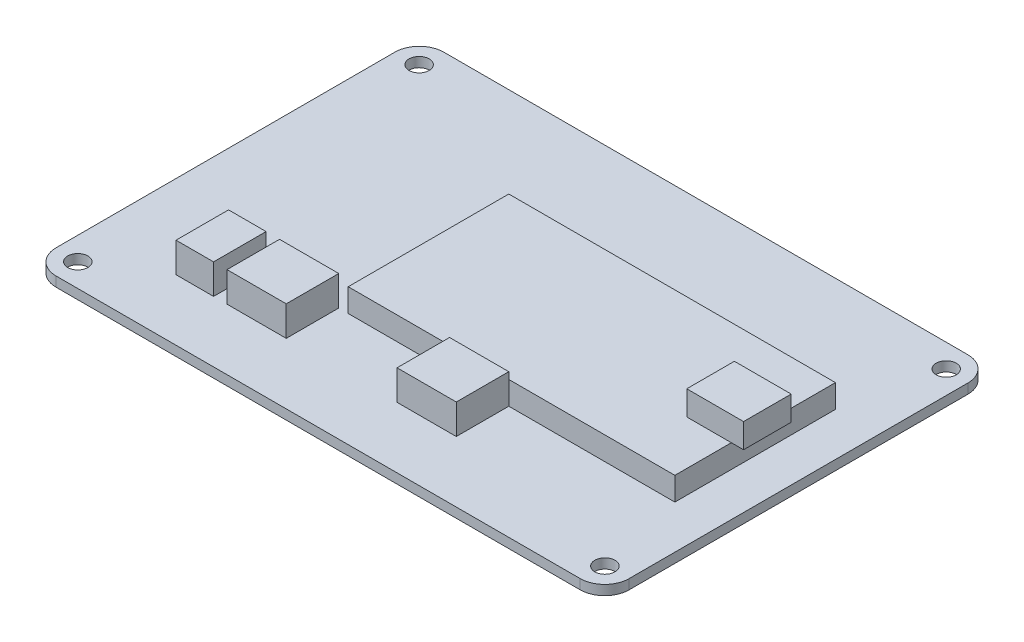
ISO-10303-21;
HEADER;
FILE_DESCRIPTION(('STEP AP214'),'2;1');
FILE_NAME('part.step','',(''),(''),'','','');
FILE_SCHEMA(('AUTOMOTIVE_DESIGN { 1 0 10303 214 1 1 1 1 }'));
ENDSEC;
DATA;
#1=APPLICATION_CONTEXT('core data for automotive mechanical design processes');
#2=APPLICATION_PROTOCOL_DEFINITION('international standard','automotive_design',2000,#1);
#3=PRODUCT_CONTEXT('',#1,'mechanical');
#4=PRODUCT('Part','Part','',(#3));
#5=PRODUCT_RELATED_PRODUCT_CATEGORY('part','',(#4));
#6=PRODUCT_DEFINITION_FORMATION('','',#4);
#7=PRODUCT_DEFINITION_CONTEXT('part definition',#1,'design');
#8=PRODUCT_DEFINITION('design','',#6,#7);
#9=PRODUCT_DEFINITION_SHAPE('','',#8);
#10=(LENGTH_UNIT() NAMED_UNIT(*) SI_UNIT(.MILLI.,.METRE.));
#11=(NAMED_UNIT(*) PLANE_ANGLE_UNIT() SI_UNIT($,.RADIAN.));
#12=(NAMED_UNIT(*) SI_UNIT($,.STERADIAN.) SOLID_ANGLE_UNIT());
#13=UNCERTAINTY_MEASURE_WITH_UNIT(LENGTH_MEASURE(1.E-05),#10,'distance_accuracy_value','');
#14=(GEOMETRIC_REPRESENTATION_CONTEXT(3) GLOBAL_UNCERTAINTY_ASSIGNED_CONTEXT((#13)) GLOBAL_UNIT_ASSIGNED_CONTEXT((#10,
#11,#12)) REPRESENTATION_CONTEXT('',''));
#15=CARTESIAN_POINT('',(0.,0.,0.));
#16=DIRECTION('',(0.,0.,1.));
#17=DIRECTION('',(1.,0.,0.));
#18=AXIS2_PLACEMENT_3D('',#15,#16,#17);
#19=CARTESIAN_POINT('',(0.,1.6,0.));
#20=DIRECTION('',(0.,1.,0.));
#21=DIRECTION('',(0.,0.,1.));
#22=AXIS2_PLACEMENT_3D('',#19,#20,#21);
#23=PLANE('',#22);
#24=CARTESIAN_POINT('',(43.1625,1.6,27.95));
#25=DIRECTION('',(0.,1.,0.));
#26=DIRECTION('',(0.,0.,1.));
#27=AXIS2_PLACEMENT_3D('',#24,#25,#26);
#28=CIRCLE('',#27,1.65);
#29=CARTESIAN_POINT('',(43.1625,1.6,29.6));
#30=VERTEX_POINT('',#29);
#31=EDGE_CURVE('E392',#30,#30,#28,.T.);
#32=ORIENTED_EDGE('',*,*,#31,.F.);
#33=EDGE_LOOP('',(#32));
#34=FACE_BOUND('',#33,.T.);
#35=CARTESIAN_POINT('',(-43.1625,1.6,-27.95));
#36=DIRECTION('',(0.,1.,0.));
#37=DIRECTION('',(0.,0.,1.));
#38=AXIS2_PLACEMENT_3D('',#35,#36,#37);
#39=CIRCLE('',#38,1.65);
#40=CARTESIAN_POINT('',(-43.1625,1.6,-26.3));
#41=VERTEX_POINT('',#40);
#42=EDGE_CURVE('E404',#41,#41,#39,.T.);
#43=ORIENTED_EDGE('',*,*,#42,.F.);
#44=EDGE_LOOP('',(#43));
#45=FACE_BOUND('',#44,.T.);
#46=DIRECTION('',(-1.,0.,0.));
#47=VECTOR('',#46,1.);
#48=CARTESIAN_POINT('',(-46.925,1.6,-31.75));
#49=LINE('',#48,#47);
#50=CARTESIAN_POINT('',(42.925,1.6,-31.75));
#51=VERTEX_POINT('',#50);
#52=CARTESIAN_POINT('',(-42.925,1.6,-31.75));
#53=VERTEX_POINT('',#52);
#54=EDGE_CURVE('E413',#51,#53,#49,.T.);
#55=ORIENTED_EDGE('',*,*,#54,.T.);
#56=CARTESIAN_POINT('',(-42.925,1.6,-27.75));
#57=DIRECTION('',(0.,1.,0.));
#58=DIRECTION('',(0.,0.,1.));
#59=AXIS2_PLACEMENT_3D('',#56,#57,#58);
#60=CIRCLE('',#59,4.);
#61=CARTESIAN_POINT('',(-46.925,1.6,-27.75));
#62=VERTEX_POINT('',#61);
#63=EDGE_CURVE('E457',#53,#62,#60,.T.);
#64=ORIENTED_EDGE('',*,*,#63,.T.);
#65=DIRECTION('',(0.,0.,1.));
#66=VECTOR('',#65,1.);
#67=CARTESIAN_POINT('',(-46.925,1.6,-31.75));
#68=LINE('',#67,#66);
#69=CARTESIAN_POINT('',(-46.925,1.6,27.75));
#70=VERTEX_POINT('',#69);
#71=EDGE_CURVE('E417',#62,#70,#68,.T.);
#72=ORIENTED_EDGE('',*,*,#71,.T.);
#73=CARTESIAN_POINT('',(-42.925,1.6,27.75));
#74=DIRECTION('',(0.,1.,0.));
#75=DIRECTION('',(0.,0.,1.));
#76=AXIS2_PLACEMENT_3D('',#73,#74,#75);
#77=CIRCLE('',#76,4.);
#78=CARTESIAN_POINT('',(-42.925,1.6,31.75));
#79=VERTEX_POINT('',#78);
#80=EDGE_CURVE('E451',#70,#79,#77,.T.);
#81=ORIENTED_EDGE('',*,*,#80,.T.);
#82=DIRECTION('',(1.,0.,0.));
#83=VECTOR('',#82,1.);
#84=CARTESIAN_POINT('',(-46.925,1.6,31.75));
#85=LINE('',#84,#83);
#86=CARTESIAN_POINT('',(42.925,1.6,31.75));
#87=VERTEX_POINT('',#86);
#88=EDGE_CURVE('E420',#79,#87,#85,.T.);
#89=ORIENTED_EDGE('',*,*,#88,.T.);
#90=CARTESIAN_POINT('',(42.925,1.6,27.75));
#91=DIRECTION('',(0.,1.,0.));
#92=DIRECTION('',(0.,0.,1.));
#93=AXIS2_PLACEMENT_3D('',#90,#91,#92);
#94=CIRCLE('',#93,4.);
#95=CARTESIAN_POINT('',(46.925,1.6,27.75));
#96=VERTEX_POINT('',#95);
#97=EDGE_CURVE('E453',#87,#96,#94,.T.);
#98=ORIENTED_EDGE('',*,*,#97,.T.);
#99=DIRECTION('',(0.,0.,-1.));
#100=VECTOR('',#99,1.);
#101=CARTESIAN_POINT('',(46.925,1.6,-31.75));
#102=LINE('',#101,#100);
#103=CARTESIAN_POINT('',(46.925,1.6,-27.75));
#104=VERTEX_POINT('',#103);
#105=EDGE_CURVE('E410',#96,#104,#102,.T.);
#106=ORIENTED_EDGE('',*,*,#105,.T.);
#107=CARTESIAN_POINT('',(42.925,1.6,-27.75));
#108=DIRECTION('',(0.,1.,0.));
#109=DIRECTION('',(0.,0.,1.));
#110=AXIS2_PLACEMENT_3D('',#107,#108,#109);
#111=CIRCLE('',#110,4.);
#112=EDGE_CURVE('E455',#104,#51,#111,.T.);
#113=ORIENTED_EDGE('',*,*,#112,.T.);
#114=EDGE_LOOP('',(#55,#64,#72,#81,#89,#98,#106,#113));
#115=FACE_BOUND('',#114,.T.);
#116=CARTESIAN_POINT('',(43.1625,1.6,-27.95));
#117=DIRECTION('',(0.,1.,0.));
#118=DIRECTION('',(0.,0.,-1.));
#119=AXIS2_PLACEMENT_3D('',#116,#117,#118);
#120=CIRCLE('',#119,1.65);
#121=CARTESIAN_POINT('',(43.1625,1.6,-29.6));
#122=VERTEX_POINT('',#121);
#123=EDGE_CURVE('E398',#122,#122,#120,.T.);
#124=ORIENTED_EDGE('',*,*,#123,.F.);
#125=EDGE_LOOP('',(#124));
#126=FACE_BOUND('',#125,.T.);
#127=CARTESIAN_POINT('',(-43.1625,1.6,27.95));
#128=DIRECTION('',(0.,1.,0.));
#129=DIRECTION('',(0.,0.,-1.));
#130=AXIS2_PLACEMENT_3D('',#127,#128,#129);
#131=CIRCLE('',#130,1.65);
#132=CARTESIAN_POINT('',(-43.1625,1.6,26.3));
#133=VERTEX_POINT('',#132);
#134=EDGE_CURVE('E386',#133,#133,#131,.T.);
#135=ORIENTED_EDGE('',*,*,#134,.F.);
#136=EDGE_LOOP('',(#135));
#137=FACE_BOUND('',#136,.T.);
#138=DIRECTION('',(1.,0.,0.));
#139=VECTOR('',#138,1.);
#140=CARTESIAN_POINT('',(2.925,1.6,21.75));
#141=LINE('',#140,#139);
#142=CARTESIAN_POINT('',(2.925,1.6,21.75));
#143=VERTEX_POINT('',#142);
#144=CARTESIAN_POINT('',(12.625,1.6,21.75));
#145=VERTEX_POINT('',#144);
#146=EDGE_CURVE('E303',#143,#145,#141,.T.);
#147=ORIENTED_EDGE('',*,*,#146,.F.);
#148=DIRECTION('',(0.,0.,1.));
#149=VECTOR('',#148,1.);
#150=CARTESIAN_POINT('',(2.925,1.6,13.15));
#151=LINE('',#150,#149);
#152=CARTESIAN_POINT('',(2.925,1.6,13.15));
#153=VERTEX_POINT('',#152);
#154=EDGE_CURVE('E289',#153,#143,#151,.T.);
#155=ORIENTED_EDGE('',*,*,#154,.F.);
#156=DIRECTION('',(1.,0.,0.));
#157=VECTOR('',#156,1.);
#158=CARTESIAN_POINT('',(-13.675,1.6,13.15));
#159=LINE('',#158,#157);
#160=CARTESIAN_POINT('',(-13.675,1.6,13.15));
#161=VERTEX_POINT('',#160);
#162=EDGE_CURVE('E373',#161,#153,#159,.T.);
#163=ORIENTED_EDGE('',*,*,#162,.F.);
#164=DIRECTION('',(0.,0.,1.));
#165=VECTOR('',#164,1.);
#166=CARTESIAN_POINT('',(-13.675,1.6,-13.15));
#167=LINE('',#166,#165);
#168=CARTESIAN_POINT('',(-13.675,1.6,-13.15));
#169=VERTEX_POINT('',#168);
#170=EDGE_CURVE('E369',#169,#161,#167,.T.);
#171=ORIENTED_EDGE('',*,*,#170,.F.);
#172=DIRECTION('',(-1.,0.,0.));
#173=VECTOR('',#172,1.);
#174=CARTESIAN_POINT('',(-13.675,1.6,-13.15));
#175=LINE('',#174,#173);
#176=CARTESIAN_POINT('',(39.825,1.6,-13.15));
#177=VERTEX_POINT('',#176);
#178=EDGE_CURVE('E367',#177,#169,#175,.T.);
#179=ORIENTED_EDGE('',*,*,#178,.F.);
#180=DIRECTION('',(0.,0.,-1.));
#181=VECTOR('',#180,1.);
#182=CARTESIAN_POINT('',(39.825,1.6,-13.15));
#183=LINE('',#182,#181);
#184=CARTESIAN_POINT('',(39.825,1.6,13.15));
#185=VERTEX_POINT('',#184);
#186=EDGE_CURVE('E349',#185,#177,#183,.T.);
#187=ORIENTED_EDGE('',*,*,#186,.F.);
#188=CARTESIAN_POINT('',(12.625,1.6,13.15));
#189=VERTEX_POINT('',#188);
#190=EDGE_CURVE('E372',#189,#185,#159,.T.);
#191=ORIENTED_EDGE('',*,*,#190,.F.);
#192=DIRECTION('',(0.,0.,-1.));
#193=VECTOR('',#192,1.);
#194=CARTESIAN_POINT('',(12.625,1.6,13.15));
#195=LINE('',#194,#193);
#196=EDGE_CURVE('E294',#145,#189,#195,.T.);
#197=ORIENTED_EDGE('',*,*,#196,.F.);
#198=EDGE_LOOP('',(#147,#155,#163,#171,#179,#187,#191,#197));
#199=FACE_BOUND('',#198,.T.);
#200=DIRECTION('',(-1.,0.,0.));
#201=VECTOR('',#200,1.);
#202=CARTESIAN_POINT('',(-15.225,1.6,13.15));
#203=LINE('',#202,#201);
#204=CARTESIAN_POINT('',(-15.225,1.6,13.15));
#205=VERTEX_POINT('',#204);
#206=CARTESIAN_POINT('',(-24.925,1.6,13.15));
#207=VERTEX_POINT('',#206);
#208=EDGE_CURVE('E261',#205,#207,#203,.T.);
#209=ORIENTED_EDGE('',*,*,#208,.F.);
#210=DIRECTION('',(0.,0.,-1.));
#211=VECTOR('',#210,1.);
#212=CARTESIAN_POINT('',(-15.225,1.6,13.15));
#213=LINE('',#212,#211);
#214=CARTESIAN_POINT('',(-15.225,1.6,21.75));
#215=VERTEX_POINT('',#214);
#216=EDGE_CURVE('E258',#215,#205,#213,.T.);
#217=ORIENTED_EDGE('',*,*,#216,.F.);
#218=DIRECTION('',(1.,0.,0.));
#219=VECTOR('',#218,1.);
#220=CARTESIAN_POINT('',(-15.225,1.6,21.75));
#221=LINE('',#220,#219);
#222=CARTESIAN_POINT('',(-24.925,1.6,21.75));
#223=VERTEX_POINT('',#222);
#224=EDGE_CURVE('E270',#223,#215,#221,.T.);
#225=ORIENTED_EDGE('',*,*,#224,.F.);
#226=DIRECTION('',(0.,0.,1.));
#227=VECTOR('',#226,1.);
#228=CARTESIAN_POINT('',(-24.925,1.6,13.15));
#229=LINE('',#228,#227);
#230=EDGE_CURVE('E278',#207,#223,#229,.T.);
#231=ORIENTED_EDGE('',*,*,#230,.F.);
#232=EDGE_LOOP('',(#209,#217,#225,#231));
#233=FACE_BOUND('',#232,.T.);
#234=DIRECTION('',(-1.,0.,0.));
#235=VECTOR('',#234,1.);
#236=CARTESIAN_POINT('',(-27.125,1.6,13.15));
#237=LINE('',#236,#235);
#238=CARTESIAN_POINT('',(-27.125,1.6,13.15));
#239=VERTEX_POINT('',#238);
#240=CARTESIAN_POINT('',(-33.2769593956546,1.6,13.15));
#241=VERTEX_POINT('',#240);
#242=EDGE_CURVE('E851',#239,#241,#237,.T.);
#243=ORIENTED_EDGE('',*,*,#242,.F.);
#244=DIRECTION('',(0.,0.,-1.));
#245=VECTOR('',#244,1.);
#246=CARTESIAN_POINT('',(-27.125,1.6,13.15));
#247=LINE('',#246,#245);
#248=CARTESIAN_POINT('',(-27.125,1.6,21.75));
#249=VERTEX_POINT('',#248);
#250=EDGE_CURVE('E256',#249,#239,#247,.T.);
#251=ORIENTED_EDGE('',*,*,#250,.F.);
#252=DIRECTION('',(1.,0.,0.));
#253=VECTOR('',#252,1.);
#254=CARTESIAN_POINT('',(-27.125,1.6,21.75));
#255=LINE('',#254,#253);
#256=CARTESIAN_POINT('',(-33.2769593956546,1.6,21.75));
#257=VERTEX_POINT('',#256);
#258=EDGE_CURVE('E252',#257,#249,#255,.T.);
#259=ORIENTED_EDGE('',*,*,#258,.F.);
#260=DIRECTION('',(0.,0.,1.));
#261=VECTOR('',#260,1.);
#262=CARTESIAN_POINT('',(-33.2769593956546,1.6,13.15));
#263=LINE('',#262,#261);
#264=EDGE_CURVE('E853',#241,#257,#263,.T.);
#265=ORIENTED_EDGE('',*,*,#264,.F.);
#266=EDGE_LOOP('',(#243,#251,#259,#265));
#267=FACE_BOUND('',#266,.T.);
#268=ADVANCED_FACE('F33',(#34,#45,#115,#126,#137,#199,#233,#267),#23,.T.);
#269=CARTESIAN_POINT('',(-13.675,5.4,13.15));
#270=DIRECTION('',(0.,0.,-1.));
#271=DIRECTION('',(-1.,0.,0.));
#272=AXIS2_PLACEMENT_3D('',#269,#270,#271);
#273=PLANE('',#272);
#274=DIRECTION('',(0.,-1.,0.));
#275=VECTOR('',#274,1.);
#276=CARTESIAN_POINT('',(2.925,6.5,13.15));
#277=LINE('',#276,#275);
#278=CARTESIAN_POINT('',(2.925,5.4,13.15));
#279=VERTEX_POINT('',#278);
#280=EDGE_CURVE('E300',#279,#153,#277,.T.);
#281=ORIENTED_EDGE('',*,*,#280,.F.);
#282=DIRECTION('',(1.,0.,0.));
#283=VECTOR('',#282,1.);
#284=CARTESIAN_POINT('',(-13.675,5.4,13.15));
#285=LINE('',#284,#283);
#286=CARTESIAN_POINT('',(-13.675,5.4,13.15));
#287=VERTEX_POINT('',#286);
#288=EDGE_CURVE('E360',#287,#279,#285,.T.);
#289=ORIENTED_EDGE('',*,*,#288,.F.);
#290=DIRECTION('',(0.,-1.,0.));
#291=VECTOR('',#290,1.);
#292=CARTESIAN_POINT('',(-13.675,5.4,13.15));
#293=LINE('',#292,#291);
#294=EDGE_CURVE('E378',#287,#161,#293,.T.);
#295=ORIENTED_EDGE('',*,*,#294,.T.);
#296=ORIENTED_EDGE('',*,*,#162,.T.);
#297=EDGE_LOOP('',(#281,#289,#295,#296));
#298=FACE_BOUND('',#297,.T.);
#299=ADVANCED_FACE('F515',(#298),#273,.F.);
#300=DIRECTION('',(0.,-1.,0.));
#301=VECTOR('',#300,1.);
#302=CARTESIAN_POINT('',(12.625,6.5,13.15));
#303=LINE('',#302,#301);
#304=CARTESIAN_POINT('',(12.625,5.4,13.15));
#305=VERTEX_POINT('',#304);
#306=EDGE_CURVE('E309',#305,#189,#303,.T.);
#307=ORIENTED_EDGE('',*,*,#306,.T.);
#308=ORIENTED_EDGE('',*,*,#190,.T.);
#309=DIRECTION('',(0.,-1.,0.));
#310=VECTOR('',#309,1.);
#311=CARTESIAN_POINT('',(39.825,5.4,13.15));
#312=LINE('',#311,#310);
#313=CARTESIAN_POINT('',(39.825,5.4,13.15));
#314=VERTEX_POINT('',#313);
#315=EDGE_CURVE('E363',#314,#185,#312,.T.);
#316=ORIENTED_EDGE('',*,*,#315,.F.);
#317=EDGE_CURVE('E359',#305,#314,#285,.T.);
#318=ORIENTED_EDGE('',*,*,#317,.F.);
#319=EDGE_LOOP('',(#307,#308,#316,#318));
#320=FACE_BOUND('',#319,.T.);
#321=ADVANCED_FACE('F521',(#320),#273,.F.);
#322=CARTESIAN_POINT('',(0.,0.,0.));
#323=DIRECTION('',(0.,1.,0.));
#324=DIRECTION('',(0.,0.,1.));
#325=AXIS2_PLACEMENT_3D('',#322,#323,#324);
#326=PLANE('',#325);
#327=DIRECTION('',(0.,0.,1.));
#328=VECTOR('',#327,1.);
#329=CARTESIAN_POINT('',(-46.925,0.,-31.75));
#330=LINE('',#329,#328);
#331=CARTESIAN_POINT('',(-46.925,0.,-27.75));
#332=VERTEX_POINT('',#331);
#333=CARTESIAN_POINT('',(-46.925,0.,27.75));
#334=VERTEX_POINT('',#333);
#335=EDGE_CURVE('E429',#332,#334,#330,.T.);
#336=ORIENTED_EDGE('',*,*,#335,.F.);
#337=CARTESIAN_POINT('',(-42.925,0.,-27.75));
#338=DIRECTION('',(0.,1.,0.));
#339=DIRECTION('',(0.,0.,1.));
#340=AXIS2_PLACEMENT_3D('',#337,#338,#339);
#341=CIRCLE('',#340,4.);
#342=CARTESIAN_POINT('',(-42.925,0.,-31.75));
#343=VERTEX_POINT('',#342);
#344=EDGE_CURVE('E444',#332,#343,#341,.F.);
#345=ORIENTED_EDGE('',*,*,#344,.T.);
#346=DIRECTION('',(-1.,0.,0.));
#347=VECTOR('',#346,1.);
#348=CARTESIAN_POINT('',(-46.925,0.,-31.75));
#349=LINE('',#348,#347);
#350=CARTESIAN_POINT('',(42.925,0.,-31.75));
#351=VERTEX_POINT('',#350);
#352=EDGE_CURVE('E426',#351,#343,#349,.T.);
#353=ORIENTED_EDGE('',*,*,#352,.F.);
#354=CARTESIAN_POINT('',(42.925,0.,-27.75));
#355=DIRECTION('',(0.,1.,0.));
#356=DIRECTION('',(0.,0.,1.));
#357=AXIS2_PLACEMENT_3D('',#354,#355,#356);
#358=CIRCLE('',#357,4.);
#359=CARTESIAN_POINT('',(46.925,0.,-27.75));
#360=VERTEX_POINT('',#359);
#361=EDGE_CURVE('E442',#351,#360,#358,.F.);
#362=ORIENTED_EDGE('',*,*,#361,.T.);
#363=DIRECTION('',(0.,0.,-1.));
#364=VECTOR('',#363,1.);
#365=CARTESIAN_POINT('',(46.925,0.,-31.75));
#366=LINE('',#365,#364);
#367=CARTESIAN_POINT('',(46.925,0.,27.75));
#368=VERTEX_POINT('',#367);
#369=EDGE_CURVE('E407',#368,#360,#366,.T.);
#370=ORIENTED_EDGE('',*,*,#369,.F.);
#371=CARTESIAN_POINT('',(42.925,0.,27.75));
#372=DIRECTION('',(0.,1.,0.));
#373=DIRECTION('',(0.,0.,1.));
#374=AXIS2_PLACEMENT_3D('',#371,#372,#373);
#375=CIRCLE('',#374,4.);
#376=CARTESIAN_POINT('',(42.925,0.,31.75));
#377=VERTEX_POINT('',#376);
#378=EDGE_CURVE('E440',#368,#377,#375,.F.);
#379=ORIENTED_EDGE('',*,*,#378,.T.);
#380=DIRECTION('',(1.,0.,0.));
#381=VECTOR('',#380,1.);
#382=CARTESIAN_POINT('',(-46.925,0.,31.75));
#383=LINE('',#382,#381);
#384=CARTESIAN_POINT('',(-42.925,0.,31.75));
#385=VERTEX_POINT('',#384);
#386=EDGE_CURVE('E414',#385,#377,#383,.T.);
#387=ORIENTED_EDGE('',*,*,#386,.F.);
#388=CARTESIAN_POINT('',(-42.925,0.,27.75));
#389=DIRECTION('',(0.,1.,0.));
#390=DIRECTION('',(0.,0.,1.));
#391=AXIS2_PLACEMENT_3D('',#388,#389,#390);
#392=CIRCLE('',#391,4.);
#393=EDGE_CURVE('E438',#385,#334,#392,.F.);
#394=ORIENTED_EDGE('',*,*,#393,.T.);
#395=EDGE_LOOP('',(#336,#345,#353,#362,#370,#379,#387,#394));
#396=FACE_BOUND('',#395,.T.);
#397=CARTESIAN_POINT('',(-43.1625,0.,-27.95));
#398=DIRECTION('',(0.,1.,0.));
#399=DIRECTION('',(0.,0.,1.));
#400=AXIS2_PLACEMENT_3D('',#397,#398,#399);
#401=CIRCLE('',#400,1.65);
#402=CARTESIAN_POINT('',(-43.1625,0.,-26.3));
#403=VERTEX_POINT('',#402);
#404=EDGE_CURVE('E401',#403,#403,#401,.T.);
#405=ORIENTED_EDGE('',*,*,#404,.T.);
#406=EDGE_LOOP('',(#405));
#407=FACE_BOUND('',#406,.T.);
#408=CARTESIAN_POINT('',(43.1625,0.,-27.95));
#409=DIRECTION('',(0.,1.,0.));
#410=DIRECTION('',(0.,0.,-1.));
#411=AXIS2_PLACEMENT_3D('',#408,#409,#410);
#412=CIRCLE('',#411,1.65);
#413=CARTESIAN_POINT('',(43.1625,0.,-29.6));
#414=VERTEX_POINT('',#413);
#415=EDGE_CURVE('E395',#414,#414,#412,.T.);
#416=ORIENTED_EDGE('',*,*,#415,.T.);
#417=EDGE_LOOP('',(#416));
#418=FACE_BOUND('',#417,.T.);
#419=CARTESIAN_POINT('',(43.1625,0.,27.95));
#420=DIRECTION('',(0.,1.,0.));
#421=DIRECTION('',(0.,0.,1.));
#422=AXIS2_PLACEMENT_3D('',#419,#420,#421);
#423=CIRCLE('',#422,1.65);
#424=CARTESIAN_POINT('',(43.1625,0.,29.6));
#425=VERTEX_POINT('',#424);
#426=EDGE_CURVE('E389',#425,#425,#423,.T.);
#427=ORIENTED_EDGE('',*,*,#426,.T.);
#428=EDGE_LOOP('',(#427));
#429=FACE_BOUND('',#428,.T.);
#430=CARTESIAN_POINT('',(-43.1625,0.,27.95));
#431=DIRECTION('',(0.,1.,0.));
#432=DIRECTION('',(0.,0.,-1.));
#433=AXIS2_PLACEMENT_3D('',#430,#431,#432);
#434=CIRCLE('',#433,1.65);
#435=CARTESIAN_POINT('',(-43.1625,0.,26.3));
#436=VERTEX_POINT('',#435);
#437=EDGE_CURVE('E385',#436,#436,#434,.T.);
#438=ORIENTED_EDGE('',*,*,#437,.T.);
#439=EDGE_LOOP('',(#438));
#440=FACE_BOUND('',#439,.T.);
#441=ADVANCED_FACE('F485',(#396,#407,#418,#429,#440),#326,.F.);
#442=CARTESIAN_POINT('',(46.925,1.6,-31.75));
#443=DIRECTION('',(-1.,0.,0.));
#444=DIRECTION('',(0.,0.,1.));
#445=AXIS2_PLACEMENT_3D('',#442,#443,#444);
#446=PLANE('',#445);
#447=ORIENTED_EDGE('',*,*,#369,.T.);
#448=DIRECTION('',(0.,-1.,0.));
#449=VECTOR('',#448,1.);
#450=CARTESIAN_POINT('',(46.925,1.6,-27.75));
#451=LINE('',#450,#449);
#452=EDGE_CURVE('E462',#360,#104,#451,.F.);
#453=ORIENTED_EDGE('',*,*,#452,.T.);
#454=ORIENTED_EDGE('',*,*,#105,.F.);
#455=DIRECTION('',(0.,-1.,0.));
#456=VECTOR('',#455,1.);
#457=CARTESIAN_POINT('',(46.925,1.6,27.75));
#458=LINE('',#457,#456);
#459=EDGE_CURVE('E459',#96,#368,#458,.T.);
#460=ORIENTED_EDGE('',*,*,#459,.T.);
#461=EDGE_LOOP('',(#447,#453,#454,#460));
#462=FACE_BOUND('',#461,.T.);
#463=ADVANCED_FACE('F481',(#462),#446,.F.);
#464=CARTESIAN_POINT('',(-46.925,1.6,-31.75));
#465=DIRECTION('',(0.,0.,1.));
#466=DIRECTION('',(1.,0.,0.));
#467=AXIS2_PLACEMENT_3D('',#464,#465,#466);
#468=PLANE('',#467);
#469=ORIENTED_EDGE('',*,*,#352,.T.);
#470=DIRECTION('',(0.,-1.,0.));
#471=VECTOR('',#470,1.);
#472=CARTESIAN_POINT('',(-42.925,1.6,-31.75));
#473=LINE('',#472,#471);
#474=EDGE_CURVE('E449',#343,#53,#473,.F.);
#475=ORIENTED_EDGE('',*,*,#474,.T.);
#476=ORIENTED_EDGE('',*,*,#54,.F.);
#477=DIRECTION('',(0.,-1.,0.));
#478=VECTOR('',#477,1.);
#479=CARTESIAN_POINT('',(42.925,1.6,-31.75));
#480=LINE('',#479,#478);
#481=EDGE_CURVE('E446',#51,#351,#480,.T.);
#482=ORIENTED_EDGE('',*,*,#481,.T.);
#483=EDGE_LOOP('',(#469,#475,#476,#482));
#484=FACE_BOUND('',#483,.T.);
#485=ADVANCED_FACE('F494',(#484),#468,.F.);
#486=CARTESIAN_POINT('',(-46.925,1.6,-31.75));
#487=DIRECTION('',(1.,0.,0.));
#488=DIRECTION('',(0.,0.,-1.));
#489=AXIS2_PLACEMENT_3D('',#486,#487,#488);
#490=PLANE('',#489);
#491=ORIENTED_EDGE('',*,*,#71,.F.);
#492=DIRECTION('',(0.,-1.,0.));
#493=VECTOR('',#492,1.);
#494=CARTESIAN_POINT('',(-46.925,1.6,-27.75));
#495=LINE('',#494,#493);
#496=EDGE_CURVE('E435',#62,#332,#495,.T.);
#497=ORIENTED_EDGE('',*,*,#496,.T.);
#498=ORIENTED_EDGE('',*,*,#335,.T.);
#499=DIRECTION('',(0.,-1.,0.));
#500=VECTOR('',#499,1.);
#501=CARTESIAN_POINT('',(-46.925,1.6,27.75));
#502=LINE('',#501,#500);
#503=EDGE_CURVE('E423',#334,#70,#502,.F.);
#504=ORIENTED_EDGE('',*,*,#503,.T.);
#505=EDGE_LOOP('',(#491,#497,#498,#504));
#506=FACE_BOUND('',#505,.T.);
#507=ADVANCED_FACE('F502',(#506),#490,.F.);
#508=CARTESIAN_POINT('',(-46.925,1.6,31.75));
#509=DIRECTION('',(0.,0.,-1.));
#510=DIRECTION('',(-1.,0.,0.));
#511=AXIS2_PLACEMENT_3D('',#508,#509,#510);
#512=PLANE('',#511);
#513=ORIENTED_EDGE('',*,*,#386,.T.);
#514=DIRECTION('',(0.,-1.,0.));
#515=VECTOR('',#514,1.);
#516=CARTESIAN_POINT('',(42.925,1.6,31.75));
#517=LINE('',#516,#515);
#518=EDGE_CURVE('E37',#377,#87,#517,.F.);
#519=ORIENTED_EDGE('',*,*,#518,.T.);
#520=ORIENTED_EDGE('',*,*,#88,.F.);
#521=DIRECTION('',(0.,-1.,0.));
#522=VECTOR('',#521,1.);
#523=CARTESIAN_POINT('',(-42.925,1.6,31.75));
#524=LINE('',#523,#522);
#525=EDGE_CURVE('E463',#79,#385,#524,.T.);
#526=ORIENTED_EDGE('',*,*,#525,.T.);
#527=EDGE_LOOP('',(#513,#519,#520,#526));
#528=FACE_BOUND('',#527,.T.);
#529=ADVANCED_FACE('F470',(#528),#512,.F.);
#530=CARTESIAN_POINT('',(-43.1625,1.6,-27.95));
#531=DIRECTION('',(0.,-1.,0.));
#532=DIRECTION('',(0.,0.,-1.));
#533=AXIS2_PLACEMENT_3D('',#530,#531,#532);
#534=CYLINDRICAL_SURFACE('',#533,1.65);
#535=ORIENTED_EDGE('',*,*,#42,.T.);
#536=EDGE_LOOP('',(#535));
#537=FACE_BOUND('',#536,.T.);
#538=ORIENTED_EDGE('',*,*,#404,.F.);
#539=EDGE_LOOP('',(#538));
#540=FACE_BOUND('',#539,.T.);
#541=ADVANCED_FACE('F528',(#537,#540),#534,.F.);
#542=CARTESIAN_POINT('',(43.1625,1.6,-27.95));
#543=DIRECTION('',(0.,-1.,0.));
#544=DIRECTION('',(0.,0.,-1.));
#545=AXIS2_PLACEMENT_3D('',#542,#543,#544);
#546=CYLINDRICAL_SURFACE('',#545,1.65);
#547=ORIENTED_EDGE('',*,*,#123,.T.);
#548=EDGE_LOOP('',(#547));
#549=FACE_BOUND('',#548,.T.);
#550=ORIENTED_EDGE('',*,*,#415,.F.);
#551=EDGE_LOOP('',(#550));
#552=FACE_BOUND('',#551,.T.);
#553=ADVANCED_FACE('F821',(#549,#552),#546,.F.);
#554=CARTESIAN_POINT('',(43.1625,1.6,27.95));
#555=DIRECTION('',(0.,-1.,0.));
#556=DIRECTION('',(0.,0.,-1.));
#557=AXIS2_PLACEMENT_3D('',#554,#555,#556);
#558=CYLINDRICAL_SURFACE('',#557,1.65);
#559=ORIENTED_EDGE('',*,*,#31,.T.);
#560=EDGE_LOOP('',(#559));
#561=FACE_BOUND('',#560,.T.);
#562=ORIENTED_EDGE('',*,*,#426,.F.);
#563=EDGE_LOOP('',(#562));
#564=FACE_BOUND('',#563,.T.);
#565=ADVANCED_FACE('F818',(#561,#564),#558,.F.);
#566=CARTESIAN_POINT('',(-43.1625,1.6,27.95));
#567=DIRECTION('',(0.,-1.,0.));
#568=DIRECTION('',(0.,0.,-1.));
#569=AXIS2_PLACEMENT_3D('',#566,#567,#568);
#570=CYLINDRICAL_SURFACE('',#569,1.65);
#571=ORIENTED_EDGE('',*,*,#134,.T.);
#572=EDGE_LOOP('',(#571));
#573=FACE_BOUND('',#572,.T.);
#574=ORIENTED_EDGE('',*,*,#437,.F.);
#575=EDGE_LOOP('',(#574));
#576=FACE_BOUND('',#575,.T.);
#577=ADVANCED_FACE('F542',(#573,#576),#570,.F.);
#578=CARTESIAN_POINT('',(-42.925,1.6,-27.75));
#579=DIRECTION('',(0.,-1.,0.));
#580=DIRECTION('',(0.,0.,-1.));
#581=AXIS2_PLACEMENT_3D('',#578,#579,#580);
#582=CYLINDRICAL_SURFACE('',#581,4.);
#583=ORIENTED_EDGE('',*,*,#63,.F.);
#584=ORIENTED_EDGE('',*,*,#474,.F.);
#585=ORIENTED_EDGE('',*,*,#344,.F.);
#586=ORIENTED_EDGE('',*,*,#496,.F.);
#587=EDGE_LOOP('',(#583,#584,#585,#586));
#588=FACE_BOUND('',#587,.T.);
#589=ADVANCED_FACE('F500',(#588),#582,.T.);
#590=CARTESIAN_POINT('',(42.925,1.6,-27.75));
#591=DIRECTION('',(0.,-1.,0.));
#592=DIRECTION('',(0.,0.,-1.));
#593=AXIS2_PLACEMENT_3D('',#590,#591,#592);
#594=CYLINDRICAL_SURFACE('',#593,4.);
#595=ORIENTED_EDGE('',*,*,#112,.F.);
#596=ORIENTED_EDGE('',*,*,#452,.F.);
#597=ORIENTED_EDGE('',*,*,#361,.F.);
#598=ORIENTED_EDGE('',*,*,#481,.F.);
#599=EDGE_LOOP('',(#595,#596,#597,#598));
#600=FACE_BOUND('',#599,.T.);
#601=ADVANCED_FACE('F491',(#600),#594,.T.);
#602=CARTESIAN_POINT('',(42.925,1.6,27.75));
#603=DIRECTION('',(0.,-1.,0.));
#604=DIRECTION('',(0.,0.,-1.));
#605=AXIS2_PLACEMENT_3D('',#602,#603,#604);
#606=CYLINDRICAL_SURFACE('',#605,4.);
#607=ORIENTED_EDGE('',*,*,#97,.F.);
#608=ORIENTED_EDGE('',*,*,#518,.F.);
#609=ORIENTED_EDGE('',*,*,#378,.F.);
#610=ORIENTED_EDGE('',*,*,#459,.F.);
#611=EDGE_LOOP('',(#607,#608,#609,#610));
#612=FACE_BOUND('',#611,.T.);
#613=ADVANCED_FACE('F478',(#612),#606,.T.);
#614=CARTESIAN_POINT('',(-42.925,1.6,27.75));
#615=DIRECTION('',(0.,-1.,0.));
#616=DIRECTION('',(0.,0.,-1.));
#617=AXIS2_PLACEMENT_3D('',#614,#615,#616);
#618=CYLINDRICAL_SURFACE('',#617,4.);
#619=ORIENTED_EDGE('',*,*,#80,.F.);
#620=ORIENTED_EDGE('',*,*,#503,.F.);
#621=ORIENTED_EDGE('',*,*,#393,.F.);
#622=ORIENTED_EDGE('',*,*,#525,.F.);
#623=EDGE_LOOP('',(#619,#620,#621,#622));
#624=FACE_BOUND('',#623,.T.);
#625=ADVANCED_FACE('F35',(#624),#618,.T.);
#626=CARTESIAN_POINT('',(39.825,5.4,-13.15));
#627=DIRECTION('',(-1.,0.,0.));
#628=DIRECTION('',(0.,0.,1.));
#629=AXIS2_PLACEMENT_3D('',#626,#627,#628);
#630=PLANE('',#629);
#631=ORIENTED_EDGE('',*,*,#186,.T.);
#632=DIRECTION('',(0.,-1.,0.));
#633=VECTOR('',#632,1.);
#634=CARTESIAN_POINT('',(39.825,5.4,-13.15));
#635=LINE('',#634,#633);
#636=CARTESIAN_POINT('',(39.825,5.4,-13.15));
#637=VERTEX_POINT('',#636);
#638=EDGE_CURVE('E383',#637,#177,#635,.T.);
#639=ORIENTED_EDGE('',*,*,#638,.F.);
#640=DIRECTION('',(0.,0.,-1.));
#641=VECTOR('',#640,1.);
#642=CARTESIAN_POINT('',(39.825,5.4,-13.15));
#643=LINE('',#642,#641);
#644=CARTESIAN_POINT('',(39.825,5.4,-3.90000000000002));
#645=VERTEX_POINT('',#644);
#646=EDGE_CURVE('E355',#645,#637,#643,.T.);
#647=ORIENTED_EDGE('',*,*,#646,.F.);
#648=CARTESIAN_POINT('',(39.825,5.4,3.89999999999998));
#649=VERTEX_POINT('',#648);
#650=EDGE_CURVE('E354',#649,#645,#643,.T.);
#651=ORIENTED_EDGE('',*,*,#650,.F.);
#652=EDGE_CURVE('E350',#314,#649,#643,.T.);
#653=ORIENTED_EDGE('',*,*,#652,.F.);
#654=ORIENTED_EDGE('',*,*,#315,.T.);
#655=EDGE_LOOP('',(#631,#639,#647,#651,#653,#654));
#656=FACE_BOUND('',#655,.T.);
#657=ADVANCED_FACE('F506',(#656),#630,.F.);
#658=CARTESIAN_POINT('',(-13.675,5.4,-13.15));
#659=DIRECTION('',(0.,0.,1.));
#660=DIRECTION('',(1.,0.,0.));
#661=AXIS2_PLACEMENT_3D('',#658,#659,#660);
#662=PLANE('',#661);
#663=ORIENTED_EDGE('',*,*,#178,.T.);
#664=DIRECTION('',(0.,-1.,0.));
#665=VECTOR('',#664,1.);
#666=CARTESIAN_POINT('',(-13.675,5.4,-13.15));
#667=LINE('',#666,#665);
#668=CARTESIAN_POINT('',(-13.675,5.4,-13.15));
#669=VERTEX_POINT('',#668);
#670=EDGE_CURVE('E380',#669,#169,#667,.T.);
#671=ORIENTED_EDGE('',*,*,#670,.F.);
#672=DIRECTION('',(-1.,0.,0.));
#673=VECTOR('',#672,1.);
#674=CARTESIAN_POINT('',(-13.675,5.4,-13.15));
#675=LINE('',#674,#673);
#676=EDGE_CURVE('E353',#637,#669,#675,.T.);
#677=ORIENTED_EDGE('',*,*,#676,.F.);
#678=ORIENTED_EDGE('',*,*,#638,.T.);
#679=EDGE_LOOP('',(#663,#671,#677,#678));
#680=FACE_BOUND('',#679,.T.);
#681=ADVANCED_FACE('F511',(#680),#662,.F.);
#682=CARTESIAN_POINT('',(-13.675,5.4,-13.15));
#683=DIRECTION('',(1.,0.,0.));
#684=DIRECTION('',(0.,0.,-1.));
#685=AXIS2_PLACEMENT_3D('',#682,#683,#684);
#686=PLANE('',#685);
#687=ORIENTED_EDGE('',*,*,#170,.T.);
#688=ORIENTED_EDGE('',*,*,#294,.F.);
#689=DIRECTION('',(0.,0.,1.));
#690=VECTOR('',#689,1.);
#691=CARTESIAN_POINT('',(-13.675,5.4,-13.15));
#692=LINE('',#691,#690);
#693=EDGE_CURVE('E357',#669,#287,#692,.T.);
#694=ORIENTED_EDGE('',*,*,#693,.F.);
#695=ORIENTED_EDGE('',*,*,#670,.T.);
#696=EDGE_LOOP('',(#687,#688,#694,#695));
#697=FACE_BOUND('',#696,.T.);
#698=ADVANCED_FACE('F567',(#697),#686,.F.);
#699=CARTESIAN_POINT('',(0.,5.4,0.));
#700=DIRECTION('',(0.,1.,0.));
#701=DIRECTION('',(0.,0.,1.));
#702=AXIS2_PLACEMENT_3D('',#699,#700,#701);
#703=PLANE('',#702);
#704=DIRECTION('',(1.,0.,0.));
#705=VECTOR('',#704,1.);
#706=CARTESIAN_POINT('',(32.525,5.4,3.89999999999998));
#707=LINE('',#706,#705);
#708=CARTESIAN_POINT('',(32.525,5.4,3.89999999999998));
#709=VERTEX_POINT('',#708);
#710=EDGE_CURVE('E322',#709,#649,#707,.T.);
#711=ORIENTED_EDGE('',*,*,#710,.F.);
#712=DIRECTION('',(0.,0.,1.));
#713=VECTOR('',#712,1.);
#714=CARTESIAN_POINT('',(32.525,5.4,3.89999999999998));
#715=LINE('',#714,#713);
#716=CARTESIAN_POINT('',(32.525,5.4,-3.90000000000002));
#717=VERTEX_POINT('',#716);
#718=EDGE_CURVE('E332',#717,#709,#715,.T.);
#719=ORIENTED_EDGE('',*,*,#718,.F.);
#720=DIRECTION('',(-1.,0.,0.));
#721=VECTOR('',#720,1.);
#722=CARTESIAN_POINT('',(32.525,5.4,-3.90000000000002));
#723=LINE('',#722,#721);
#724=EDGE_CURVE('E11',#645,#717,#723,.T.);
#725=ORIENTED_EDGE('',*,*,#724,.F.);
#726=ORIENTED_EDGE('',*,*,#646,.T.);
#727=ORIENTED_EDGE('',*,*,#676,.T.);
#728=ORIENTED_EDGE('',*,*,#693,.T.);
#729=ORIENTED_EDGE('',*,*,#288,.T.);
#730=EDGE_CURVE('E364',#279,#305,#285,.T.);
#731=ORIENTED_EDGE('',*,*,#730,.T.);
#732=ORIENTED_EDGE('',*,*,#317,.T.);
#733=ORIENTED_EDGE('',*,*,#652,.T.);
#734=EDGE_LOOP('',(#711,#719,#725,#726,#727,#728,#729,#731,#732,#733));
#735=FACE_BOUND('',#734,.T.);
#736=ADVANCED_FACE('F577',(#735),#703,.T.);
#737=CARTESIAN_POINT('',(41.825,9.4,3.89999999999998));
#738=DIRECTION('',(-1.,0.,0.));
#739=DIRECTION('',(0.,0.,1.));
#740=AXIS2_PLACEMENT_3D('',#737,#738,#739);
#741=PLANE('',#740);
#742=DIRECTION('',(0.,0.,-1.));
#743=VECTOR('',#742,1.);
#744=CARTESIAN_POINT('',(41.825,5.4,3.89999999999998));
#745=LINE('',#744,#743);
#746=CARTESIAN_POINT('',(41.825,5.4,3.89999999999998));
#747=VERTEX_POINT('',#746);
#748=CARTESIAN_POINT('',(41.825,5.4,-3.90000000000002));
#749=VERTEX_POINT('',#748);
#750=EDGE_CURVE('E317',#747,#749,#745,.T.);
#751=ORIENTED_EDGE('',*,*,#750,.T.);
#752=DIRECTION('',(0.,-1.,0.));
#753=VECTOR('',#752,1.);
#754=CARTESIAN_POINT('',(41.825,9.4,-3.90000000000002));
#755=LINE('',#754,#753);
#756=CARTESIAN_POINT('',(41.825,9.4,-3.90000000000002));
#757=VERTEX_POINT('',#756);
#758=EDGE_CURVE('E346',#757,#749,#755,.T.);
#759=ORIENTED_EDGE('',*,*,#758,.F.);
#760=DIRECTION('',(0.,0.,-1.));
#761=VECTOR('',#760,1.);
#762=CARTESIAN_POINT('',(41.825,9.4,3.89999999999998));
#763=LINE('',#762,#761);
#764=CARTESIAN_POINT('',(41.825,9.4,3.89999999999998));
#765=VERTEX_POINT('',#764);
#766=EDGE_CURVE('E318',#765,#757,#763,.T.);
#767=ORIENTED_EDGE('',*,*,#766,.F.);
#768=DIRECTION('',(0.,-1.,0.));
#769=VECTOR('',#768,1.);
#770=CARTESIAN_POINT('',(41.825,9.4,3.89999999999998));
#771=LINE('',#770,#769);
#772=EDGE_CURVE('E328',#765,#747,#771,.T.);
#773=ORIENTED_EDGE('',*,*,#772,.T.);
#774=EDGE_LOOP('',(#751,#759,#767,#773));
#775=FACE_BOUND('',#774,.T.);
#776=ADVANCED_FACE('F590',(#775),#741,.F.);
#777=CARTESIAN_POINT('',(32.525,9.4,-3.90000000000002));
#778=DIRECTION('',(0.,0.,1.));
#779=DIRECTION('',(1.,0.,0.));
#780=AXIS2_PLACEMENT_3D('',#777,#778,#779);
#781=PLANE('',#780);
#782=EDGE_CURVE('E43',#749,#645,#723,.T.);
#783=ORIENTED_EDGE('',*,*,#782,.T.);
#784=ORIENTED_EDGE('',*,*,#724,.T.);
#785=DIRECTION('',(0.,-1.,0.));
#786=VECTOR('',#785,1.);
#787=CARTESIAN_POINT('',(32.525,9.4,-3.90000000000002));
#788=LINE('',#787,#786);
#789=CARTESIAN_POINT('',(32.525,9.4,-3.90000000000002));
#790=VERTEX_POINT('',#789);
#791=EDGE_CURVE('E343',#790,#717,#788,.T.);
#792=ORIENTED_EDGE('',*,*,#791,.F.);
#793=DIRECTION('',(-1.,0.,0.));
#794=VECTOR('',#793,1.);
#795=CARTESIAN_POINT('',(32.525,9.4,-3.90000000000002));
#796=LINE('',#795,#794);
#797=EDGE_CURVE('E321',#757,#790,#796,.T.);
#798=ORIENTED_EDGE('',*,*,#797,.F.);
#799=ORIENTED_EDGE('',*,*,#758,.T.);
#800=EDGE_LOOP('',(#783,#784,#792,#798,#799));
#801=FACE_BOUND('',#800,.T.);
#802=ADVANCED_FACE('F595',(#801),#781,.F.);
#803=CARTESIAN_POINT('',(32.525,9.4,3.89999999999998));
#804=DIRECTION('',(1.,0.,0.));
#805=DIRECTION('',(0.,0.,-1.));
#806=AXIS2_PLACEMENT_3D('',#803,#804,#805);
#807=PLANE('',#806);
#808=ORIENTED_EDGE('',*,*,#718,.T.);
#809=DIRECTION('',(0.,-1.,0.));
#810=VECTOR('',#809,1.);
#811=CARTESIAN_POINT('',(32.525,9.4,3.89999999999998));
#812=LINE('',#811,#810);
#813=CARTESIAN_POINT('',(32.525,9.4,3.89999999999998));
#814=VERTEX_POINT('',#813);
#815=EDGE_CURVE('E340',#814,#709,#812,.T.);
#816=ORIENTED_EDGE('',*,*,#815,.F.);
#817=DIRECTION('',(0.,0.,1.));
#818=VECTOR('',#817,1.);
#819=CARTESIAN_POINT('',(32.525,9.4,3.89999999999998));
#820=LINE('',#819,#818);
#821=EDGE_CURVE('E324',#790,#814,#820,.T.);
#822=ORIENTED_EDGE('',*,*,#821,.F.);
#823=ORIENTED_EDGE('',*,*,#791,.T.);
#824=EDGE_LOOP('',(#808,#816,#822,#823));
#825=FACE_BOUND('',#824,.T.);
#826=ADVANCED_FACE('F605',(#825),#807,.F.);
#827=CARTESIAN_POINT('',(32.525,9.4,3.89999999999998));
#828=DIRECTION('',(0.,0.,-1.));
#829=DIRECTION('',(-1.,0.,0.));
#830=AXIS2_PLACEMENT_3D('',#827,#828,#829);
#831=PLANE('',#830);
#832=ORIENTED_EDGE('',*,*,#710,.T.);
#833=EDGE_CURVE('E335',#649,#747,#707,.T.);
#834=ORIENTED_EDGE('',*,*,#833,.T.);
#835=ORIENTED_EDGE('',*,*,#772,.F.);
#836=DIRECTION('',(1.,0.,0.));
#837=VECTOR('',#836,1.);
#838=CARTESIAN_POINT('',(32.525,9.4,3.89999999999998));
#839=LINE('',#838,#837);
#840=EDGE_CURVE('E326',#814,#765,#839,.T.);
#841=ORIENTED_EDGE('',*,*,#840,.F.);
#842=ORIENTED_EDGE('',*,*,#815,.T.);
#843=EDGE_LOOP('',(#832,#834,#835,#841,#842));
#844=FACE_BOUND('',#843,.T.);
#845=ADVANCED_FACE('F615',(#844),#831,.F.);
#846=CARTESIAN_POINT('',(0.,9.4,0.));
#847=DIRECTION('',(0.,-1.,0.));
#848=DIRECTION('',(0.,0.,-1.));
#849=AXIS2_PLACEMENT_3D('',#846,#847,#848);
#850=PLANE('',#849);
#851=ORIENTED_EDGE('',*,*,#766,.T.);
#852=ORIENTED_EDGE('',*,*,#797,.T.);
#853=ORIENTED_EDGE('',*,*,#821,.T.);
#854=ORIENTED_EDGE('',*,*,#840,.T.);
#855=EDGE_LOOP('',(#851,#852,#853,#854));
#856=FACE_BOUND('',#855,.T.);
#857=ADVANCED_FACE('F625',(#856),#850,.F.);
#858=CARTESIAN_POINT('',(0.,5.4,0.));
#859=DIRECTION('',(0.,-1.,0.));
#860=DIRECTION('',(0.,0.,-1.));
#861=AXIS2_PLACEMENT_3D('',#858,#859,#860);
#862=PLANE('',#861);
#863=ORIENTED_EDGE('',*,*,#833,.F.);
#864=ORIENTED_EDGE('',*,*,#650,.T.);
#865=ORIENTED_EDGE('',*,*,#782,.F.);
#866=ORIENTED_EDGE('',*,*,#750,.F.);
#867=EDGE_LOOP('',(#863,#864,#865,#866));
#868=FACE_BOUND('',#867,.T.);
#869=ADVANCED_FACE('F635',(#868),#862,.T.);
#870=CARTESIAN_POINT('',(2.925,6.5,13.15));
#871=DIRECTION('',(1.,0.,0.));
#872=DIRECTION('',(0.,0.,-1.));
#873=AXIS2_PLACEMENT_3D('',#870,#871,#872);
#874=PLANE('',#873);
#875=ORIENTED_EDGE('',*,*,#154,.T.);
#876=DIRECTION('',(0.,-1.,0.));
#877=VECTOR('',#876,1.);
#878=CARTESIAN_POINT('',(2.925,6.5,21.75));
#879=LINE('',#878,#877);
#880=CARTESIAN_POINT('',(2.925,6.5,21.75));
#881=VERTEX_POINT('',#880);
#882=EDGE_CURVE('E315',#881,#143,#879,.T.);
#883=ORIENTED_EDGE('',*,*,#882,.F.);
#884=DIRECTION('',(0.,0.,1.));
#885=VECTOR('',#884,1.);
#886=CARTESIAN_POINT('',(2.925,6.5,13.15));
#887=LINE('',#886,#885);
#888=CARTESIAN_POINT('',(2.925,6.5,13.15));
#889=VERTEX_POINT('',#888);
#890=EDGE_CURVE('E290',#889,#881,#887,.T.);
#891=ORIENTED_EDGE('',*,*,#890,.F.);
#892=EDGE_CURVE('E306',#889,#279,#277,.T.);
#893=ORIENTED_EDGE('',*,*,#892,.T.);
#894=ORIENTED_EDGE('',*,*,#280,.T.);
#895=EDGE_LOOP('',(#875,#883,#891,#893,#894));
#896=FACE_BOUND('',#895,.T.);
#897=ADVANCED_FACE('F644',(#896),#874,.F.);
#898=CARTESIAN_POINT('',(2.925,6.5,21.75));
#899=DIRECTION('',(0.,0.,-1.));
#900=DIRECTION('',(-1.,0.,0.));
#901=AXIS2_PLACEMENT_3D('',#898,#899,#900);
#902=PLANE('',#901);
#903=ORIENTED_EDGE('',*,*,#146,.T.);
#904=DIRECTION('',(0.,-1.,0.));
#905=VECTOR('',#904,1.);
#906=CARTESIAN_POINT('',(12.625,6.5,21.75));
#907=LINE('',#906,#905);
#908=CARTESIAN_POINT('',(12.625,6.5,21.75));
#909=VERTEX_POINT('',#908);
#910=EDGE_CURVE('E312',#909,#145,#907,.T.);
#911=ORIENTED_EDGE('',*,*,#910,.F.);
#912=DIRECTION('',(1.,0.,0.));
#913=VECTOR('',#912,1.);
#914=CARTESIAN_POINT('',(2.925,6.5,21.75));
#915=LINE('',#914,#913);
#916=EDGE_CURVE('E293',#881,#909,#915,.T.);
#917=ORIENTED_EDGE('',*,*,#916,.F.);
#918=ORIENTED_EDGE('',*,*,#882,.T.);
#919=EDGE_LOOP('',(#903,#911,#917,#918));
#920=FACE_BOUND('',#919,.T.);
#921=ADVANCED_FACE('F680',(#920),#902,.F.);
#922=CARTESIAN_POINT('',(12.625,6.5,13.15));
#923=DIRECTION('',(-1.,0.,0.));
#924=DIRECTION('',(0.,0.,1.));
#925=AXIS2_PLACEMENT_3D('',#922,#923,#924);
#926=PLANE('',#925);
#927=ORIENTED_EDGE('',*,*,#196,.T.);
#928=ORIENTED_EDGE('',*,*,#306,.F.);
#929=CARTESIAN_POINT('',(12.625,6.5,13.15));
#930=VERTEX_POINT('',#929);
#931=EDGE_CURVE('E310',#930,#305,#303,.T.);
#932=ORIENTED_EDGE('',*,*,#931,.F.);
#933=DIRECTION('',(0.,0.,-1.));
#934=VECTOR('',#933,1.);
#935=CARTESIAN_POINT('',(12.625,6.5,13.15));
#936=LINE('',#935,#934);
#937=EDGE_CURVE('E296',#909,#930,#936,.T.);
#938=ORIENTED_EDGE('',*,*,#937,.F.);
#939=ORIENTED_EDGE('',*,*,#910,.T.);
#940=EDGE_LOOP('',(#927,#928,#932,#938,#939));
#941=FACE_BOUND('',#940,.T.);
#942=ADVANCED_FACE('F690',(#941),#926,.F.);
#943=CARTESIAN_POINT('',(2.925,6.5,13.15));
#944=DIRECTION('',(0.,0.,1.));
#945=DIRECTION('',(1.,0.,0.));
#946=AXIS2_PLACEMENT_3D('',#943,#944,#945);
#947=PLANE('',#946);
#948=ORIENTED_EDGE('',*,*,#730,.F.);
#949=ORIENTED_EDGE('',*,*,#892,.F.);
#950=DIRECTION('',(-1.,0.,0.));
#951=VECTOR('',#950,1.);
#952=CARTESIAN_POINT('',(2.925,6.5,13.15));
#953=LINE('',#952,#951);
#954=EDGE_CURVE('E298',#930,#889,#953,.T.);
#955=ORIENTED_EDGE('',*,*,#954,.F.);
#956=ORIENTED_EDGE('',*,*,#931,.T.);
#957=EDGE_LOOP('',(#948,#949,#955,#956));
#958=FACE_BOUND('',#957,.T.);
#959=ADVANCED_FACE('F700',(#958),#947,.F.);
#960=CARTESIAN_POINT('',(0.,6.5,0.));
#961=DIRECTION('',(0.,1.,0.));
#962=DIRECTION('',(0.,0.,1.));
#963=AXIS2_PLACEMENT_3D('',#960,#961,#962);
#964=PLANE('',#963);
#965=ORIENTED_EDGE('',*,*,#890,.T.);
#966=ORIENTED_EDGE('',*,*,#916,.T.);
#967=ORIENTED_EDGE('',*,*,#937,.T.);
#968=ORIENTED_EDGE('',*,*,#954,.T.);
#969=EDGE_LOOP('',(#965,#966,#967,#968));
#970=FACE_BOUND('',#969,.T.);
#971=ADVANCED_FACE('F710',(#970),#964,.T.);
#972=CARTESIAN_POINT('',(-15.225,6.5,13.15));
#973=DIRECTION('',(-1.,0.,0.));
#974=DIRECTION('',(0.,0.,1.));
#975=AXIS2_PLACEMENT_3D('',#972,#973,#974);
#976=PLANE('',#975);
#977=ORIENTED_EDGE('',*,*,#216,.T.);
#978=DIRECTION('',(0.,-1.,0.));
#979=VECTOR('',#978,1.);
#980=CARTESIAN_POINT('',(-15.225,6.5,13.15));
#981=LINE('',#980,#979);
#982=CARTESIAN_POINT('',(-15.225,6.5,13.15));
#983=VERTEX_POINT('',#982);
#984=EDGE_CURVE('E287',#983,#205,#981,.T.);
#985=ORIENTED_EDGE('',*,*,#984,.F.);
#986=DIRECTION('',(0.,0.,-1.));
#987=VECTOR('',#986,1.);
#988=CARTESIAN_POINT('',(-15.225,6.5,13.15));
#989=LINE('',#988,#987);
#990=CARTESIAN_POINT('',(-15.225,6.5,21.75));
#991=VERTEX_POINT('',#990);
#992=EDGE_CURVE('E266',#991,#983,#989,.T.);
#993=ORIENTED_EDGE('',*,*,#992,.F.);
#994=DIRECTION('',(0.,-1.,0.));
#995=VECTOR('',#994,1.);
#996=CARTESIAN_POINT('',(-15.225,6.5,21.75));
#997=LINE('',#996,#995);
#998=EDGE_CURVE('E275',#991,#215,#997,.T.);
#999=ORIENTED_EDGE('',*,*,#998,.T.);
#1000=EDGE_LOOP('',(#977,#985,#993,#999));
#1001=FACE_BOUND('',#1000,.T.);
#1002=ADVANCED_FACE('F720',(#1001),#976,.F.);
#1003=CARTESIAN_POINT('',(-15.225,6.5,13.15));
#1004=DIRECTION('',(0.,0.,1.));
#1005=DIRECTION('',(1.,0.,0.));
#1006=AXIS2_PLACEMENT_3D('',#1003,#1004,#1005);
#1007=PLANE('',#1006);
#1008=ORIENTED_EDGE('',*,*,#208,.T.);
#1009=DIRECTION('',(0.,-1.,0.));
#1010=VECTOR('',#1009,1.);
#1011=CARTESIAN_POINT('',(-24.925,6.5,13.15));
#1012=LINE('',#1011,#1010);
#1013=CARTESIAN_POINT('',(-24.925,6.5,13.15));
#1014=VERTEX_POINT('',#1013);
#1015=EDGE_CURVE('E284',#1014,#207,#1012,.T.);
#1016=ORIENTED_EDGE('',*,*,#1015,.F.);
#1017=DIRECTION('',(-1.,0.,0.));
#1018=VECTOR('',#1017,1.);
#1019=CARTESIAN_POINT('',(-15.225,6.5,13.15));
#1020=LINE('',#1019,#1018);
#1021=EDGE_CURVE('E269',#983,#1014,#1020,.T.);
#1022=ORIENTED_EDGE('',*,*,#1021,.F.);
#1023=ORIENTED_EDGE('',*,*,#984,.T.);
#1024=EDGE_LOOP('',(#1008,#1016,#1022,#1023));
#1025=FACE_BOUND('',#1024,.T.);
#1026=ADVANCED_FACE('F730',(#1025),#1007,.F.);
#1027=CARTESIAN_POINT('',(-24.925,6.5,13.15));
#1028=DIRECTION('',(1.,0.,0.));
#1029=DIRECTION('',(0.,0.,-1.));
#1030=AXIS2_PLACEMENT_3D('',#1027,#1028,#1029);
#1031=PLANE('',#1030);
#1032=ORIENTED_EDGE('',*,*,#230,.T.);
#1033=DIRECTION('',(0.,-1.,0.));
#1034=VECTOR('',#1033,1.);
#1035=CARTESIAN_POINT('',(-24.925,6.5,21.75));
#1036=LINE('',#1035,#1034);
#1037=CARTESIAN_POINT('',(-24.925,6.5,21.75));
#1038=VERTEX_POINT('',#1037);
#1039=EDGE_CURVE('E58',#1038,#223,#1036,.T.);
#1040=ORIENTED_EDGE('',*,*,#1039,.F.);
#1041=DIRECTION('',(0.,0.,1.));
#1042=VECTOR('',#1041,1.);
#1043=CARTESIAN_POINT('',(-24.925,6.5,13.15));
#1044=LINE('',#1043,#1042);
#1045=EDGE_CURVE('E272',#1014,#1038,#1044,.T.);
#1046=ORIENTED_EDGE('',*,*,#1045,.F.);
#1047=ORIENTED_EDGE('',*,*,#1015,.T.);
#1048=EDGE_LOOP('',(#1032,#1040,#1046,#1047));
#1049=FACE_BOUND('',#1048,.T.);
#1050=ADVANCED_FACE('F740',(#1049),#1031,.F.);
#1051=CARTESIAN_POINT('',(-15.225,6.5,21.75));
#1052=DIRECTION('',(0.,0.,-1.));
#1053=DIRECTION('',(-1.,0.,0.));
#1054=AXIS2_PLACEMENT_3D('',#1051,#1052,#1053);
#1055=PLANE('',#1054);
#1056=ORIENTED_EDGE('',*,*,#224,.T.);
#1057=ORIENTED_EDGE('',*,*,#998,.F.);
#1058=DIRECTION('',(1.,0.,0.));
#1059=VECTOR('',#1058,1.);
#1060=CARTESIAN_POINT('',(-15.225,6.5,21.75));
#1061=LINE('',#1060,#1059);
#1062=EDGE_CURVE('E274',#1038,#991,#1061,.T.);
#1063=ORIENTED_EDGE('',*,*,#1062,.F.);
#1064=ORIENTED_EDGE('',*,*,#1039,.T.);
#1065=EDGE_LOOP('',(#1056,#1057,#1063,#1064));
#1066=FACE_BOUND('',#1065,.T.);
#1067=ADVANCED_FACE('F750',(#1066),#1055,.F.);
#1068=CARTESIAN_POINT('',(0.,6.5,0.));
#1069=DIRECTION('',(0.,-1.,0.));
#1070=DIRECTION('',(0.,0.,-1.));
#1071=AXIS2_PLACEMENT_3D('',#1068,#1069,#1070);
#1072=PLANE('',#1071);
#1073=ORIENTED_EDGE('',*,*,#992,.T.);
#1074=ORIENTED_EDGE('',*,*,#1021,.T.);
#1075=ORIENTED_EDGE('',*,*,#1045,.T.);
#1076=ORIENTED_EDGE('',*,*,#1062,.T.);
#1077=EDGE_LOOP('',(#1073,#1074,#1075,#1076));
#1078=FACE_BOUND('',#1077,.T.);
#1079=ADVANCED_FACE('F760',(#1078),#1072,.F.);
#1080=CARTESIAN_POINT('',(-27.125,6.5,13.15));
#1081=DIRECTION('',(-1.,0.,0.));
#1082=DIRECTION('',(0.,0.,1.));
#1083=AXIS2_PLACEMENT_3D('',#1080,#1081,#1082);
#1084=PLANE('',#1083);
#1085=ORIENTED_EDGE('',*,*,#250,.T.);
#1086=DIRECTION('',(0.,-1.,0.));
#1087=VECTOR('',#1086,1.);
#1088=CARTESIAN_POINT('',(-27.125,6.5,13.15));
#1089=LINE('',#1088,#1087);
#1090=CARTESIAN_POINT('',(-27.125,6.5,13.15));
#1091=VERTEX_POINT('',#1090);
#1092=EDGE_CURVE('E237',#1091,#239,#1089,.T.);
#1093=ORIENTED_EDGE('',*,*,#1092,.F.);
#1094=DIRECTION('',(0.,0.,-1.));
#1095=VECTOR('',#1094,1.);
#1096=CARTESIAN_POINT('',(-27.125,6.5,13.15));
#1097=LINE('',#1096,#1095);
#1098=CARTESIAN_POINT('',(-27.125,6.5,21.75));
#1099=VERTEX_POINT('',#1098);
#1100=EDGE_CURVE('E244',#1099,#1091,#1097,.T.);
#1101=ORIENTED_EDGE('',*,*,#1100,.F.);
#1102=DIRECTION('',(0.,-1.,0.));
#1103=VECTOR('',#1102,1.);
#1104=CARTESIAN_POINT('',(-27.125,6.5,21.75));
#1105=LINE('',#1104,#1103);
#1106=EDGE_CURVE('E860',#1099,#249,#1105,.T.);
#1107=ORIENTED_EDGE('',*,*,#1106,.T.);
#1108=EDGE_LOOP('',(#1085,#1093,#1101,#1107));
#1109=FACE_BOUND('',#1108,.T.);
#1110=ADVANCED_FACE('F254',(#1109),#1084,.F.);
#1111=CARTESIAN_POINT('',(-27.125,6.5,13.15));
#1112=DIRECTION('',(0.,0.,1.));
#1113=DIRECTION('',(1.,0.,0.));
#1114=AXIS2_PLACEMENT_3D('',#1111,#1112,#1113);
#1115=PLANE('',#1114);
#1116=ORIENTED_EDGE('',*,*,#242,.T.);
#1117=DIRECTION('',(0.,-1.,0.));
#1118=VECTOR('',#1117,1.);
#1119=CARTESIAN_POINT('',(-33.2769593956546,6.5,13.15));
#1120=LINE('',#1119,#1118);
#1121=CARTESIAN_POINT('',(-33.2769593956546,6.5,13.15));
#1122=VERTEX_POINT('',#1121);
#1123=EDGE_CURVE('E240',#1122,#241,#1120,.T.);
#1124=ORIENTED_EDGE('',*,*,#1123,.F.);
#1125=DIRECTION('',(-1.,0.,0.));
#1126=VECTOR('',#1125,1.);
#1127=CARTESIAN_POINT('',(-27.125,6.5,13.15));
#1128=LINE('',#1127,#1126);
#1129=EDGE_CURVE('E233',#1091,#1122,#1128,.T.);
#1130=ORIENTED_EDGE('',*,*,#1129,.F.);
#1131=ORIENTED_EDGE('',*,*,#1092,.T.);
#1132=EDGE_LOOP('',(#1116,#1124,#1130,#1131));
#1133=FACE_BOUND('',#1132,.T.);
#1134=ADVANCED_FACE('F235',(#1133),#1115,.F.);
#1135=CARTESIAN_POINT('',(-33.2769593956546,6.5,13.15));
#1136=DIRECTION('',(1.,0.,0.));
#1137=DIRECTION('',(0.,0.,-1.));
#1138=AXIS2_PLACEMENT_3D('',#1135,#1136,#1137);
#1139=PLANE('',#1138);
#1140=ORIENTED_EDGE('',*,*,#264,.T.);
#1141=DIRECTION('',(0.,-1.,0.));
#1142=VECTOR('',#1141,1.);
#1143=CARTESIAN_POINT('',(-33.2769593956546,6.5,21.75));
#1144=LINE('',#1143,#1142);
#1145=CARTESIAN_POINT('',(-33.2769593956546,6.5,21.75));
#1146=VERTEX_POINT('',#1145);
#1147=EDGE_CURVE('E50',#1146,#257,#1144,.T.);
#1148=ORIENTED_EDGE('',*,*,#1147,.F.);
#1149=DIRECTION('',(0.,0.,1.));
#1150=VECTOR('',#1149,1.);
#1151=CARTESIAN_POINT('',(-33.2769593956546,6.5,13.15));
#1152=LINE('',#1151,#1150);
#1153=EDGE_CURVE('E243',#1122,#1146,#1152,.T.);
#1154=ORIENTED_EDGE('',*,*,#1153,.F.);
#1155=ORIENTED_EDGE('',*,*,#1123,.T.);
#1156=EDGE_LOOP('',(#1140,#1148,#1154,#1155));
#1157=FACE_BOUND('',#1156,.T.);
#1158=ADVANCED_FACE('F786',(#1157),#1139,.F.);
#1159=CARTESIAN_POINT('',(-27.125,6.5,21.75));
#1160=DIRECTION('',(0.,0.,-1.));
#1161=DIRECTION('',(-1.,0.,0.));
#1162=AXIS2_PLACEMENT_3D('',#1159,#1160,#1161);
#1163=PLANE('',#1162);
#1164=ORIENTED_EDGE('',*,*,#258,.T.);
#1165=ORIENTED_EDGE('',*,*,#1106,.F.);
#1166=DIRECTION('',(1.,0.,0.));
#1167=VECTOR('',#1166,1.);
#1168=CARTESIAN_POINT('',(-27.125,6.5,21.75));
#1169=LINE('',#1168,#1167);
#1170=EDGE_CURVE('E248',#1146,#1099,#1169,.T.);
#1171=ORIENTED_EDGE('',*,*,#1170,.F.);
#1172=ORIENTED_EDGE('',*,*,#1147,.T.);
#1173=EDGE_LOOP('',(#1164,#1165,#1171,#1172));
#1174=FACE_BOUND('',#1173,.T.);
#1175=ADVANCED_FACE('F795',(#1174),#1163,.F.);
#1176=CARTESIAN_POINT('',(0.,6.5,0.));
#1177=DIRECTION('',(0.,-1.,0.));
#1178=DIRECTION('',(0.,0.,-1.));
#1179=AXIS2_PLACEMENT_3D('',#1176,#1177,#1178);
#1180=PLANE('',#1179);
#1181=ORIENTED_EDGE('',*,*,#1100,.T.);
#1182=ORIENTED_EDGE('',*,*,#1129,.T.);
#1183=ORIENTED_EDGE('',*,*,#1153,.T.);
#1184=ORIENTED_EDGE('',*,*,#1170,.T.);
#1185=EDGE_LOOP('',(#1181,#1182,#1183,#1184));
#1186=FACE_BOUND('',#1185,.T.);
#1187=ADVANCED_FACE('F247',(#1186),#1180,.F.);
#1188=CLOSED_SHELL('',(#268,#299,#321,#441,#463,#485,#507,#529,#541,#553,#565,#577,#589,#601,
#613,#625,#657,#681,#698,#736,#776,#802,#826,#845,#857,#869,#897,#921,#942,#959,#971,#1002,
#1026,#1050,#1067,#1079,#1110,#1134,#1158,#1175,#1187));
#1189=MANIFOLD_SOLID_BREP('B2',#1188);
#1190=ADVANCED_BREP_SHAPE_REPRESENTATION('',(#18,#1189),#14);
#1191=SHAPE_DEFINITION_REPRESENTATION(#9,#1190);
ENDSEC;
END-ISO-10303-21;
